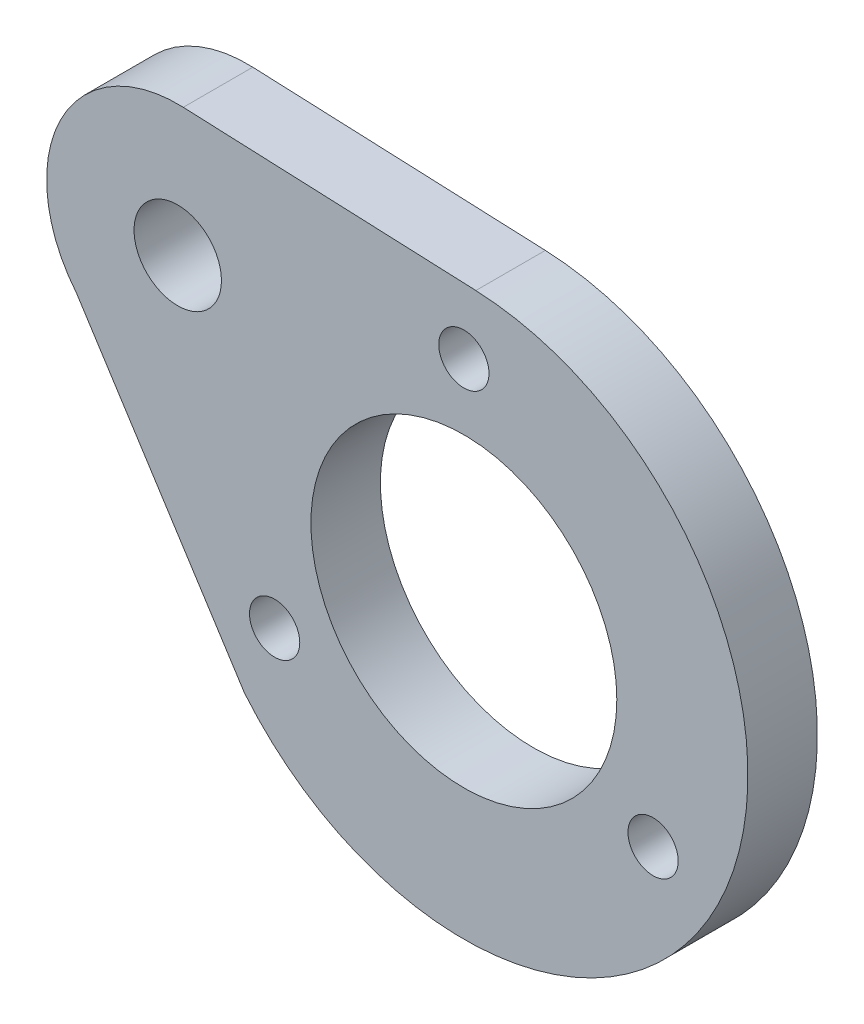
ISO-10303-21;
HEADER;
FILE_DESCRIPTION(('STEP AP214'),'2;1');
FILE_NAME('part.step','',(''),(''),'','','');
FILE_SCHEMA(('AUTOMOTIVE_DESIGN { 1 0 10303 214 1 1 1 1 }'));
ENDSEC;
DATA;
#1=APPLICATION_CONTEXT('core data for automotive mechanical design processes');
#2=APPLICATION_PROTOCOL_DEFINITION('international standard','automotive_design',2000,#1);
#3=PRODUCT_CONTEXT('',#1,'mechanical');
#4=PRODUCT('Part','Part','',(#3));
#5=PRODUCT_RELATED_PRODUCT_CATEGORY('part','',(#4));
#6=PRODUCT_DEFINITION_FORMATION('','',#4);
#7=PRODUCT_DEFINITION_CONTEXT('part definition',#1,'design');
#8=PRODUCT_DEFINITION('design','',#6,#7);
#9=PRODUCT_DEFINITION_SHAPE('','',#8);
#10=(LENGTH_UNIT() NAMED_UNIT(*) SI_UNIT(.MILLI.,.METRE.));
#11=(NAMED_UNIT(*) PLANE_ANGLE_UNIT() SI_UNIT($,.RADIAN.));
#12=(NAMED_UNIT(*) SI_UNIT($,.STERADIAN.) SOLID_ANGLE_UNIT());
#13=UNCERTAINTY_MEASURE_WITH_UNIT(LENGTH_MEASURE(1.E-05),#10,'distance_accuracy_value','');
#14=(GEOMETRIC_REPRESENTATION_CONTEXT(3) GLOBAL_UNCERTAINTY_ASSIGNED_CONTEXT((#13)) GLOBAL_UNIT_ASSIGNED_CONTEXT((#10,
#11,#12)) REPRESENTATION_CONTEXT('',''));
#15=CARTESIAN_POINT('',(0.,0.,0.));
#16=DIRECTION('',(0.,0.,1.));
#17=DIRECTION('',(1.,0.,0.));
#18=AXIS2_PLACEMENT_3D('',#15,#16,#17);
#19=CARTESIAN_POINT('',(2.49980850957624,59.1126553380104,1.59));
#20=DIRECTION('',(0.0422511257951753,0.999107022480095,0.));
#21=DIRECTION('',(-0.999107022480095,0.0422511257951753,0.));
#22=AXIS2_PLACEMENT_3D('',#19,#20,#21);
#23=PLANE('',#22);
#24=DIRECTION('',(0.999107022480095,-0.0422511257951753,0.));
#25=VECTOR('',#24,1.);
#26=CARTESIAN_POINT('',(2.49980850957624,59.1126553380104,0.));
#27=LINE('',#26,#25);
#28=CARTESIAN_POINT('',(38.9345905043687,57.5718688929702,0.));
#29=VERTEX_POINT('',#28);
#30=CARTESIAN_POINT('',(45.6296214972622,57.2887434716503,0.));
#31=VERTEX_POINT('',#30);
#32=EDGE_CURVE('E106',#29,#31,#27,.T.);
#33=ORIENTED_EDGE('',*,*,#32,.F.);
#34=DIRECTION('',(0.,0.,-1.));
#35=VECTOR('',#34,1.);
#36=CARTESIAN_POINT('',(38.9345905043687,57.5718688929702,1.59));
#37=LINE('',#36,#35);
#38=CARTESIAN_POINT('',(38.9345905043687,57.5718688929702,1.59));
#39=VERTEX_POINT('',#38);
#40=EDGE_CURVE('E11',#39,#29,#37,.T.);
#41=ORIENTED_EDGE('',*,*,#40,.F.);
#42=DIRECTION('',(0.999107022480095,-0.0422511257951753,0.));
#43=VECTOR('',#42,1.);
#44=CARTESIAN_POINT('',(2.49980850957624,59.1126553380104,1.59));
#45=LINE('',#44,#43);
#46=CARTESIAN_POINT('',(45.6296214972622,57.2887434716503,1.59));
#47=VERTEX_POINT('',#46);
#48=EDGE_CURVE('E92',#39,#47,#45,.T.);
#49=ORIENTED_EDGE('',*,*,#48,.T.);
#50=DIRECTION('',(0.,0.,-1.));
#51=VECTOR('',#50,1.);
#52=CARTESIAN_POINT('',(45.6296214972622,57.2887434716503,1.59));
#53=LINE('',#52,#51);
#54=EDGE_CURVE('E74',#47,#31,#53,.T.);
#55=ORIENTED_EDGE('',*,*,#54,.T.);
#56=EDGE_LOOP('',(#33,#41,#49,#55));
#57=FACE_BOUND('',#56,.T.);
#58=ADVANCED_FACE('F35',(#57),#23,.T.);
#59=CARTESIAN_POINT('',(38.8078371269833,54.5745478255301,1.59));
#60=DIRECTION('',(0.,0.,-1.));
#61=DIRECTION('',(-1.,0.,0.));
#62=AXIS2_PLACEMENT_3D('',#59,#60,#61);
#63=CYLINDRICAL_SURFACE('',#62,3.00000000000009);
#64=CARTESIAN_POINT('',(38.8078371269833,54.5745478255301,0.));
#65=DIRECTION('',(0.,0.,1.));
#66=DIRECTION('',(1.,0.,0.));
#67=AXIS2_PLACEMENT_3D('',#64,#65,#66);
#68=CIRCLE('',#67,3.00000000000009);
#69=CARTESIAN_POINT('',(36.489726939884,52.6702460741081,0.));
#70=VERTEX_POINT('',#69);
#71=EDGE_CURVE('E97',#29,#70,#68,.T.);
#72=ORIENTED_EDGE('',*,*,#71,.T.);
#73=DIRECTION('',(0.,0.,-1.));
#74=VECTOR('',#73,1.);
#75=CARTESIAN_POINT('',(36.489726939884,52.6702460741081,1.59));
#76=LINE('',#75,#74);
#77=CARTESIAN_POINT('',(36.489726939884,52.6702460741081,1.59));
#78=VERTEX_POINT('',#77);
#79=EDGE_CURVE('E44',#78,#70,#76,.T.);
#80=ORIENTED_EDGE('',*,*,#79,.F.);
#81=CARTESIAN_POINT('',(38.8078371269833,54.5745478255301,1.59));
#82=DIRECTION('',(0.,0.,1.));
#83=DIRECTION('',(1.,0.,0.));
#84=AXIS2_PLACEMENT_3D('',#81,#82,#83);
#85=CIRCLE('',#84,3.00000000000009);
#86=EDGE_CURVE('E89',#39,#78,#85,.T.);
#87=ORIENTED_EDGE('',*,*,#86,.F.);
#88=ORIENTED_EDGE('',*,*,#40,.T.);
#89=EDGE_LOOP('',(#72,#80,#87,#88));
#90=FACE_BOUND('',#89,.T.);
#91=ADVANCED_FACE('F95',(#90),#63,.T.);
#92=CARTESIAN_POINT('',(49.7983172358544,31.8842944937698,1.59));
#93=DIRECTION('',(0.842168714467095,0.539214109953402,0.));
#94=DIRECTION('',(-0.539214109953402,0.842168714467095,0.));
#95=AXIS2_PLACEMENT_3D('',#92,#93,#94);
#96=PLANE('',#95);
#97=DIRECTION('',(0.539214109953402,-0.842168714467095,0.));
#98=VECTOR('',#97,1.);
#99=CARTESIAN_POINT('',(49.7983172358544,31.8842944937698,0.));
#100=LINE('',#99,#98);
#101=CARTESIAN_POINT('',(40.3324171075458,46.6685606974499,0.));
#102=VERTEX_POINT('',#101);
#103=EDGE_CURVE('E103',#70,#102,#100,.T.);
#104=ORIENTED_EDGE('',*,*,#103,.T.);
#105=DIRECTION('',(0.,0.,-1.));
#106=VECTOR('',#105,1.);
#107=CARTESIAN_POINT('',(40.3324171075458,46.6685606974499,1.59));
#108=LINE('',#107,#106);
#109=CARTESIAN_POINT('',(40.3324171075458,46.6685606974499,1.59));
#110=VERTEX_POINT('',#109);
#111=EDGE_CURVE('E88',#110,#102,#108,.T.);
#112=ORIENTED_EDGE('',*,*,#111,.F.);
#113=DIRECTION('',(0.539214109953402,-0.842168714467095,0.));
#114=VECTOR('',#113,1.);
#115=CARTESIAN_POINT('',(49.7983172358544,31.8842944937698,1.59));
#116=LINE('',#115,#114);
#117=EDGE_CURVE('E82',#78,#110,#116,.T.);
#118=ORIENTED_EDGE('',*,*,#117,.F.);
#119=ORIENTED_EDGE('',*,*,#79,.T.);
#120=EDGE_LOOP('',(#104,#112,#118,#119));
#121=FACE_BOUND('',#120,.T.);
#122=ADVANCED_FACE('F85',(#121),#96,.F.);
#123=CARTESIAN_POINT('',(38.8078371269833,54.5745478255301,1.59));
#124=DIRECTION('',(0.,0.,-1.));
#125=DIRECTION('',(-1.,0.,0.));
#126=AXIS2_PLACEMENT_3D('',#123,#124,#125);
#127=CYLINDRICAL_SURFACE('',#126,0.999999999999123);
#128=CARTESIAN_POINT('',(38.8078371269833,54.5745478255301,1.59));
#129=DIRECTION('',(0.,0.,1.));
#130=DIRECTION('',(1.,0.,0.));
#131=AXIS2_PLACEMENT_3D('',#128,#129,#130);
#132=CIRCLE('',#131,0.999999999999123);
#133=CARTESIAN_POINT('',(39.8078371269824,54.5745478255301,1.59));
#134=VERTEX_POINT('',#133);
#135=EDGE_CURVE('E125',#134,#134,#132,.T.);
#136=ORIENTED_EDGE('',*,*,#135,.T.);
#137=EDGE_LOOP('',(#136));
#138=FACE_BOUND('',#137,.T.);
#139=CARTESIAN_POINT('',(38.8078371269833,54.5745478255301,0.));
#140=DIRECTION('',(0.,0.,1.));
#141=DIRECTION('',(1.,0.,0.));
#142=AXIS2_PLACEMENT_3D('',#139,#140,#141);
#143=CIRCLE('',#142,0.999999999999123);
#144=CARTESIAN_POINT('',(39.8078371269824,54.5745478255301,0.));
#145=VERTEX_POINT('',#144);
#146=EDGE_CURVE('E108',#145,#145,#143,.T.);
#147=ORIENTED_EDGE('',*,*,#146,.F.);
#148=EDGE_LOOP('',(#147));
#149=FACE_BOUND('',#148,.T.);
#150=ADVANCED_FACE('F155',(#138,#149),#127,.F.);
#151=CARTESIAN_POINT('',(41.0248621606721,48.2945478255305,1.59));
#152=DIRECTION('',(0.,0.,-1.));
#153=DIRECTION('',(-1.,0.,0.));
#154=AXIS2_PLACEMENT_3D('',#151,#152,#153);
#155=CYLINDRICAL_SURFACE('',#154,0.575000000000001);
#156=CARTESIAN_POINT('',(41.0248621606721,48.2945478255305,1.59));
#157=DIRECTION('',(0.,0.,1.));
#158=DIRECTION('',(1.,0.,0.));
#159=AXIS2_PLACEMENT_3D('',#156,#157,#158);
#160=CIRCLE('',#159,0.575000000000001);
#161=CARTESIAN_POINT('',(41.5998621606721,48.2945478255305,1.59));
#162=VERTEX_POINT('',#161);
#163=EDGE_CURVE('E128',#162,#162,#160,.T.);
#164=ORIENTED_EDGE('',*,*,#163,.T.);
#165=EDGE_LOOP('',(#164));
#166=FACE_BOUND('',#165,.T.);
#167=CARTESIAN_POINT('',(41.0248621606721,48.2945478255305,0.));
#168=DIRECTION('',(0.,0.,1.));
#169=DIRECTION('',(1.,0.,0.));
#170=AXIS2_PLACEMENT_3D('',#167,#168,#169);
#171=CIRCLE('',#170,0.575000000000001);
#172=CARTESIAN_POINT('',(41.5998621606721,48.2945478255305,0.));
#173=VERTEX_POINT('',#172);
#174=EDGE_CURVE('E111',#173,#173,#171,.T.);
#175=ORIENTED_EDGE('',*,*,#174,.F.);
#176=EDGE_LOOP('',(#175));
#177=FACE_BOUND('',#176,.T.);
#178=ADVANCED_FACE('F158',(#166,#177),#155,.F.);
#179=CARTESIAN_POINT('',(49.685116198515,48.2945478255305,1.59));
#180=DIRECTION('',(0.,0.,-1.));
#181=DIRECTION('',(-1.,0.,0.));
#182=AXIS2_PLACEMENT_3D('',#179,#180,#181);
#183=CYLINDRICAL_SURFACE('',#182,0.575000000000001);
#184=CARTESIAN_POINT('',(49.685116198515,48.2945478255305,1.59));
#185=DIRECTION('',(0.,0.,1.));
#186=DIRECTION('',(1.,0.,0.));
#187=AXIS2_PLACEMENT_3D('',#184,#185,#186);
#188=CIRCLE('',#187,0.575000000000001);
#189=CARTESIAN_POINT('',(50.260116198515,48.2945478255305,1.59));
#190=VERTEX_POINT('',#189);
#191=EDGE_CURVE('E131',#190,#190,#188,.T.);
#192=ORIENTED_EDGE('',*,*,#191,.T.);
#193=EDGE_LOOP('',(#192));
#194=FACE_BOUND('',#193,.T.);
#195=CARTESIAN_POINT('',(49.685116198515,48.2945478255305,0.));
#196=DIRECTION('',(0.,0.,1.));
#197=DIRECTION('',(1.,0.,0.));
#198=AXIS2_PLACEMENT_3D('',#195,#196,#197);
#199=CIRCLE('',#198,0.575000000000001);
#200=CARTESIAN_POINT('',(50.260116198515,48.2945478255305,0.));
#201=VERTEX_POINT('',#200);
#202=EDGE_CURVE('E114',#201,#201,#199,.T.);
#203=ORIENTED_EDGE('',*,*,#202,.F.);
#204=EDGE_LOOP('',(#203));
#205=FACE_BOUND('',#204,.T.);
#206=ADVANCED_FACE('F175',(#194,#205),#183,.F.);
#207=CARTESIAN_POINT('',(45.3549891795936,55.7945478255291,1.59));
#208=DIRECTION('',(0.,0.,-1.));
#209=DIRECTION('',(-1.,0.,0.));
#210=AXIS2_PLACEMENT_3D('',#207,#208,#209);
#211=CYLINDRICAL_SURFACE('',#210,0.575000000000001);
#212=CARTESIAN_POINT('',(45.3549891795936,55.7945478255291,1.59));
#213=DIRECTION('',(0.,0.,1.));
#214=DIRECTION('',(1.,0.,0.));
#215=AXIS2_PLACEMENT_3D('',#212,#213,#214);
#216=CIRCLE('',#215,0.575000000000001);
#217=CARTESIAN_POINT('',(45.9299891795936,55.7945478255291,1.59));
#218=VERTEX_POINT('',#217);
#219=EDGE_CURVE('E134',#218,#218,#216,.T.);
#220=ORIENTED_EDGE('',*,*,#219,.T.);
#221=EDGE_LOOP('',(#220));
#222=FACE_BOUND('',#221,.T.);
#223=CARTESIAN_POINT('',(45.3549891795936,55.7945478255291,0.));
#224=DIRECTION('',(0.,0.,1.));
#225=DIRECTION('',(1.,0.,0.));
#226=AXIS2_PLACEMENT_3D('',#223,#224,#225);
#227=CIRCLE('',#226,0.575000000000001);
#228=CARTESIAN_POINT('',(45.9299891795936,55.7945478255291,0.));
#229=VERTEX_POINT('',#228);
#230=EDGE_CURVE('E117',#229,#229,#227,.T.);
#231=ORIENTED_EDGE('',*,*,#230,.F.);
#232=EDGE_LOOP('',(#231));
#233=FACE_BOUND('',#232,.T.);
#234=ADVANCED_FACE('F178',(#222,#233),#211,.F.);
#235=CARTESIAN_POINT('',(45.3549891795936,50.7945478255301,1.59));
#236=DIRECTION('',(0.,0.,-1.));
#237=DIRECTION('',(-1.,0.,0.));
#238=AXIS2_PLACEMENT_3D('',#235,#236,#237);
#239=CYLINDRICAL_SURFACE('',#238,3.49999999999919);
#240=CARTESIAN_POINT('',(45.3549891795936,50.7945478255301,1.59));
#241=DIRECTION('',(0.,0.,1.));
#242=DIRECTION('',(1.,0.,0.));
#243=AXIS2_PLACEMENT_3D('',#240,#241,#242);
#244=CIRCLE('',#243,3.49999999999919);
#245=CARTESIAN_POINT('',(48.8549891795928,50.7945478255301,1.59));
#246=VERTEX_POINT('',#245);
#247=EDGE_CURVE('E102',#246,#246,#244,.T.);
#248=ORIENTED_EDGE('',*,*,#247,.T.);
#249=EDGE_LOOP('',(#248));
#250=FACE_BOUND('',#249,.T.);
#251=CARTESIAN_POINT('',(45.3549891795936,50.7945478255301,0.));
#252=DIRECTION('',(0.,0.,1.));
#253=DIRECTION('',(1.,0.,0.));
#254=AXIS2_PLACEMENT_3D('',#251,#252,#253);
#255=CIRCLE('',#254,3.49999999999919);
#256=CARTESIAN_POINT('',(48.8549891795928,50.7945478255301,0.));
#257=VERTEX_POINT('',#256);
#258=EDGE_CURVE('E120',#257,#257,#255,.T.);
#259=ORIENTED_EDGE('',*,*,#258,.F.);
#260=EDGE_LOOP('',(#259));
#261=FACE_BOUND('',#260,.T.);
#262=ADVANCED_FACE('F37',(#250,#261),#239,.F.);
#263=CARTESIAN_POINT('',(45.3549891795936,50.7945478255301,1.59));
#264=DIRECTION('',(0.,0.,-1.));
#265=DIRECTION('',(-1.,0.,0.));
#266=AXIS2_PLACEMENT_3D('',#263,#264,#265);
#267=CYLINDRICAL_SURFACE('',#266,6.49999999999971);
#268=CARTESIAN_POINT('',(45.3549891795936,50.7945478255301,0.));
#269=DIRECTION('',(0.,0.,1.));
#270=DIRECTION('',(1.,0.,0.));
#271=AXIS2_PLACEMENT_3D('',#268,#269,#270);
#272=CIRCLE('',#271,6.49999999999971);
#273=EDGE_CURVE('E67',#102,#31,#272,.T.);
#274=ORIENTED_EDGE('',*,*,#273,.T.);
#275=ORIENTED_EDGE('',*,*,#54,.F.);
#276=CARTESIAN_POINT('',(45.3549891795936,50.7945478255301,1.59));
#277=DIRECTION('',(0.,0.,1.));
#278=DIRECTION('',(1.,0.,0.));
#279=AXIS2_PLACEMENT_3D('',#276,#277,#278);
#280=CIRCLE('',#279,6.49999999999971);
#281=EDGE_CURVE('E52',#110,#47,#280,.T.);
#282=ORIENTED_EDGE('',*,*,#281,.F.);
#283=ORIENTED_EDGE('',*,*,#111,.T.);
#284=EDGE_LOOP('',(#274,#275,#282,#283));
#285=FACE_BOUND('',#284,.T.);
#286=ADVANCED_FACE('F145',(#285),#267,.T.);
#287=CARTESIAN_POINT('',(0.,0.,1.59));
#288=DIRECTION('',(0.,0.,1.));
#289=DIRECTION('',(1.,0.,0.));
#290=AXIS2_PLACEMENT_3D('',#287,#288,#289);
#291=PLANE('',#290);
#292=ORIENTED_EDGE('',*,*,#247,.F.);
#293=EDGE_LOOP('',(#292));
#294=FACE_BOUND('',#293,.T.);
#295=ORIENTED_EDGE('',*,*,#219,.F.);
#296=EDGE_LOOP('',(#295));
#297=FACE_BOUND('',#296,.T.);
#298=ORIENTED_EDGE('',*,*,#191,.F.);
#299=EDGE_LOOP('',(#298));
#300=FACE_BOUND('',#299,.T.);
#301=ORIENTED_EDGE('',*,*,#163,.F.);
#302=EDGE_LOOP('',(#301));
#303=FACE_BOUND('',#302,.T.);
#304=ORIENTED_EDGE('',*,*,#135,.F.);
#305=EDGE_LOOP('',(#304));
#306=FACE_BOUND('',#305,.T.);
#307=ORIENTED_EDGE('',*,*,#48,.F.);
#308=ORIENTED_EDGE('',*,*,#86,.T.);
#309=ORIENTED_EDGE('',*,*,#117,.T.);
#310=ORIENTED_EDGE('',*,*,#281,.T.);
#311=EDGE_LOOP('',(#307,#308,#309,#310));
#312=FACE_BOUND('',#311,.T.);
#313=ADVANCED_FACE('F91',(#294,#297,#300,#303,#306,#312),#291,.T.);
#314=CARTESIAN_POINT('',(0.,0.,0.));
#315=DIRECTION('',(0.,0.,1.));
#316=DIRECTION('',(1.,0.,0.));
#317=AXIS2_PLACEMENT_3D('',#314,#315,#316);
#318=PLANE('',#317);
#319=ORIENTED_EDGE('',*,*,#258,.T.);
#320=EDGE_LOOP('',(#319));
#321=FACE_BOUND('',#320,.T.);
#322=ORIENTED_EDGE('',*,*,#230,.T.);
#323=EDGE_LOOP('',(#322));
#324=FACE_BOUND('',#323,.T.);
#325=ORIENTED_EDGE('',*,*,#202,.T.);
#326=EDGE_LOOP('',(#325));
#327=FACE_BOUND('',#326,.T.);
#328=ORIENTED_EDGE('',*,*,#174,.T.);
#329=EDGE_LOOP('',(#328));
#330=FACE_BOUND('',#329,.T.);
#331=ORIENTED_EDGE('',*,*,#146,.T.);
#332=EDGE_LOOP('',(#331));
#333=FACE_BOUND('',#332,.T.);
#334=ORIENTED_EDGE('',*,*,#32,.T.);
#335=ORIENTED_EDGE('',*,*,#273,.F.);
#336=ORIENTED_EDGE('',*,*,#103,.F.);
#337=ORIENTED_EDGE('',*,*,#71,.F.);
#338=EDGE_LOOP('',(#334,#335,#336,#337));
#339=FACE_BOUND('',#338,.T.);
#340=ADVANCED_FACE('F144',(#321,#324,#327,#330,#333,#339),#318,.F.);
#341=CLOSED_SHELL('',(#58,#91,#122,#150,#178,#206,#234,#262,#286,#313,#340));
#342=MANIFOLD_SOLID_BREP('B2',#341);
#343=ADVANCED_BREP_SHAPE_REPRESENTATION('',(#18,#342),#14);
#344=SHAPE_DEFINITION_REPRESENTATION(#9,#343);
ENDSEC;
END-ISO-10303-21;
